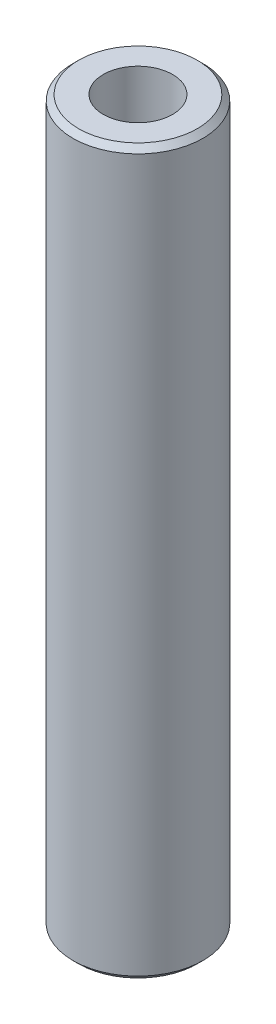
ISO-10303-21;
HEADER;
FILE_DESCRIPTION(('STEP AP214'),'2;1');
FILE_NAME('part.step','',(''),(''),'','','');
FILE_SCHEMA(('AUTOMOTIVE_DESIGN { 1 0 10303 214 1 1 1 1 }'));
ENDSEC;
DATA;
#1=APPLICATION_CONTEXT('core data for automotive mechanical design processes');
#2=APPLICATION_PROTOCOL_DEFINITION('international standard','automotive_design',2000,#1);
#3=PRODUCT_CONTEXT('',#1,'mechanical');
#4=PRODUCT('Part','Part','',(#3));
#5=PRODUCT_RELATED_PRODUCT_CATEGORY('part','',(#4));
#6=PRODUCT_DEFINITION_FORMATION('','',#4);
#7=PRODUCT_DEFINITION_CONTEXT('part definition',#1,'design');
#8=PRODUCT_DEFINITION('design','',#6,#7);
#9=PRODUCT_DEFINITION_SHAPE('','',#8);
#10=(LENGTH_UNIT() NAMED_UNIT(*) SI_UNIT(.MILLI.,.METRE.));
#11=(NAMED_UNIT(*) PLANE_ANGLE_UNIT() SI_UNIT($,.RADIAN.));
#12=(NAMED_UNIT(*) SI_UNIT($,.STERADIAN.) SOLID_ANGLE_UNIT());
#13=UNCERTAINTY_MEASURE_WITH_UNIT(LENGTH_MEASURE(1.E-05),#10,'distance_accuracy_value','');
#14=(GEOMETRIC_REPRESENTATION_CONTEXT(3) GLOBAL_UNCERTAINTY_ASSIGNED_CONTEXT((#13)) GLOBAL_UNIT_ASSIGNED_CONTEXT((#10,
#11,#12)) REPRESENTATION_CONTEXT('',''));
#15=CARTESIAN_POINT('',(0.,0.,0.));
#16=DIRECTION('',(0.,0.,1.));
#17=DIRECTION('',(1.,0.,0.));
#18=AXIS2_PLACEMENT_3D('',#15,#16,#17);
#19=CARTESIAN_POINT('',(0.,473.387259305577,0.));
#20=DIRECTION('',(0.,-1.,0.));
#21=DIRECTION('',(0.,0.,-1.));
#22=AXIS2_PLACEMENT_3D('',#19,#20,#21);
#23=CYLINDRICAL_SURFACE('',#22,42.5);
#24=CARTESIAN_POINT('',(0.,469.728546558382,0.));
#25=DIRECTION('',(0.,1.,0.));
#26=DIRECTION('',(0.,0.,1.));
#27=AXIS2_PLACEMENT_3D('',#24,#25,#26);
#28=CIRCLE('',#27,42.5);
#29=CARTESIAN_POINT('',(0.,469.728546558382,42.5));
#30=VERTEX_POINT('',#29);
#31=EDGE_CURVE('E50',#30,#30,#28,.F.);
#32=ORIENTED_EDGE('',*,*,#31,.T.);
#33=EDGE_LOOP('',(#32));
#34=FACE_BOUND('',#33,.T.);
#35=CARTESIAN_POINT('',(0.,3.65871274719431,0.));
#36=DIRECTION('',(0.,1.,0.));
#37=DIRECTION('',(0.,0.,1.));
#38=AXIS2_PLACEMENT_3D('',#35,#36,#37);
#39=CIRCLE('',#38,42.5);
#40=CARTESIAN_POINT('',(0.,3.65871274719431,42.5));
#41=VERTEX_POINT('',#40);
#42=EDGE_CURVE('E51',#41,#41,#39,.T.);
#43=ORIENTED_EDGE('',*,*,#42,.T.);
#44=EDGE_LOOP('',(#43));
#45=FACE_BOUND('',#44,.T.);
#46=ADVANCED_FACE('F39',(#34,#45),#23,.T.);
#47=CARTESIAN_POINT('',(0.,473.387259305577,0.));
#48=DIRECTION('',(0.,1.,0.));
#49=DIRECTION('',(0.,0.,1.));
#50=AXIS2_PLACEMENT_3D('',#47,#48,#49);
#51=PLANE('',#50);
#52=CARTESIAN_POINT('',(0.,473.387259305577,0.));
#53=DIRECTION('',(0.,1.,0.));
#54=DIRECTION('',(0.,0.,1.));
#55=AXIS2_PLACEMENT_3D('',#52,#53,#54);
#56=CIRCLE('',#55,38.8412872528056);
#57=CARTESIAN_POINT('',(0.,473.387259305577,38.8412872528056));
#58=VERTEX_POINT('',#57);
#59=EDGE_CURVE('E54',#58,#58,#56,.T.);
#60=ORIENTED_EDGE('',*,*,#59,.T.);
#61=EDGE_LOOP('',(#60));
#62=FACE_BOUND('',#61,.T.);
#63=CARTESIAN_POINT('',(0.,473.387259305577,0.));
#64=DIRECTION('',(0.,1.,0.));
#65=DIRECTION('',(0.,0.,1.));
#66=AXIS2_PLACEMENT_3D('',#63,#64,#65);
#67=CIRCLE('',#66,22.6833616141486);
#68=CARTESIAN_POINT('',(0.,473.387259305577,22.6833616141486));
#69=VERTEX_POINT('',#68);
#70=EDGE_CURVE('E58',#69,#69,#67,.T.);
#71=ORIENTED_EDGE('',*,*,#70,.F.);
#72=EDGE_LOOP('',(#71));
#73=FACE_BOUND('',#72,.T.);
#74=ADVANCED_FACE('F69',(#62,#73),#51,.T.);
#75=CARTESIAN_POINT('',(0.,0.,0.));
#76=DIRECTION('',(0.,1.,0.));
#77=DIRECTION('',(0.,0.,1.));
#78=AXIS2_PLACEMENT_3D('',#75,#76,#77);
#79=PLANE('',#78);
#80=CARTESIAN_POINT('',(0.,0.,0.));
#81=DIRECTION('',(0.,1.,0.));
#82=DIRECTION('',(0.,0.,1.));
#83=AXIS2_PLACEMENT_3D('',#80,#81,#82);
#84=CIRCLE('',#83,38.8412872528057);
#85=CARTESIAN_POINT('',(0.,0.,38.8412872528057));
#86=VERTEX_POINT('',#85);
#87=EDGE_CURVE('E10',#86,#86,#84,.F.);
#88=ORIENTED_EDGE('',*,*,#87,.T.);
#89=EDGE_LOOP('',(#88));
#90=FACE_BOUND('',#89,.T.);
#91=CARTESIAN_POINT('',(0.,0.,0.));
#92=DIRECTION('',(0.,1.,0.));
#93=DIRECTION('',(0.,0.,1.));
#94=AXIS2_PLACEMENT_3D('',#91,#92,#93);
#95=CIRCLE('',#94,22.6833616141486);
#96=CARTESIAN_POINT('',(0.,0.,22.6833616141486));
#97=VERTEX_POINT('',#96);
#98=EDGE_CURVE('E63',#97,#97,#95,.T.);
#99=ORIENTED_EDGE('',*,*,#98,.T.);
#100=EDGE_LOOP('',(#99));
#101=FACE_BOUND('',#100,.T.);
#102=ADVANCED_FACE('F75',(#90,#101),#79,.F.);
#103=CARTESIAN_POINT('',(0.,473.387259305577,0.));
#104=DIRECTION('',(0.,-1.,0.));
#105=DIRECTION('',(0.,0.,-1.));
#106=AXIS2_PLACEMENT_3D('',#103,#104,#105);
#107=CYLINDRICAL_SURFACE('',#106,22.6833616141486);
#108=ORIENTED_EDGE('',*,*,#70,.T.);
#109=EDGE_LOOP('',(#108));
#110=FACE_BOUND('',#109,.T.);
#111=ORIENTED_EDGE('',*,*,#98,.F.);
#112=EDGE_LOOP('',(#111));
#113=FACE_BOUND('',#112,.T.);
#114=ADVANCED_FACE('F70',(#110,#113),#107,.F.);
#115=CARTESIAN_POINT('',(0.,473.387259305577,0.));
#116=DIRECTION('',(0.,-1.,0.));
#117=DIRECTION('',(0.,0.,-1.));
#118=AXIS2_PLACEMENT_3D('',#115,#116,#117);
#119=CONICAL_SURFACE('',#118,38.8412872528056,0.785398163397445);
#120=ORIENTED_EDGE('',*,*,#31,.F.);
#121=EDGE_LOOP('',(#120));
#122=FACE_BOUND('',#121,.T.);
#123=ORIENTED_EDGE('',*,*,#59,.F.);
#124=EDGE_LOOP('',(#123));
#125=FACE_BOUND('',#124,.T.);
#126=ADVANCED_FACE('F81',(#122,#125),#119,.T.);
#127=CARTESIAN_POINT('',(0.,3.65871274719431,0.));
#128=DIRECTION('',(0.,1.,0.));
#129=DIRECTION('',(0.,0.,1.));
#130=AXIS2_PLACEMENT_3D('',#127,#128,#129);
#131=CONICAL_SURFACE('',#130,42.5,0.785398163397452);
#132=ORIENTED_EDGE('',*,*,#87,.F.);
#133=EDGE_LOOP('',(#132));
#134=FACE_BOUND('',#133,.T.);
#135=ORIENTED_EDGE('',*,*,#42,.F.);
#136=EDGE_LOOP('',(#135));
#137=FACE_BOUND('',#136,.T.);
#138=ADVANCED_FACE('F45',(#134,#137),#131,.T.);
#139=CLOSED_SHELL('',(#46,#74,#102,#114,#126,#138));
#140=MANIFOLD_SOLID_BREP('B2',#139);
#141=ADVANCED_BREP_SHAPE_REPRESENTATION('',(#18,#140),#14);
#142=SHAPE_DEFINITION_REPRESENTATION(#9,#141);
ENDSEC;
END-ISO-10303-21;
